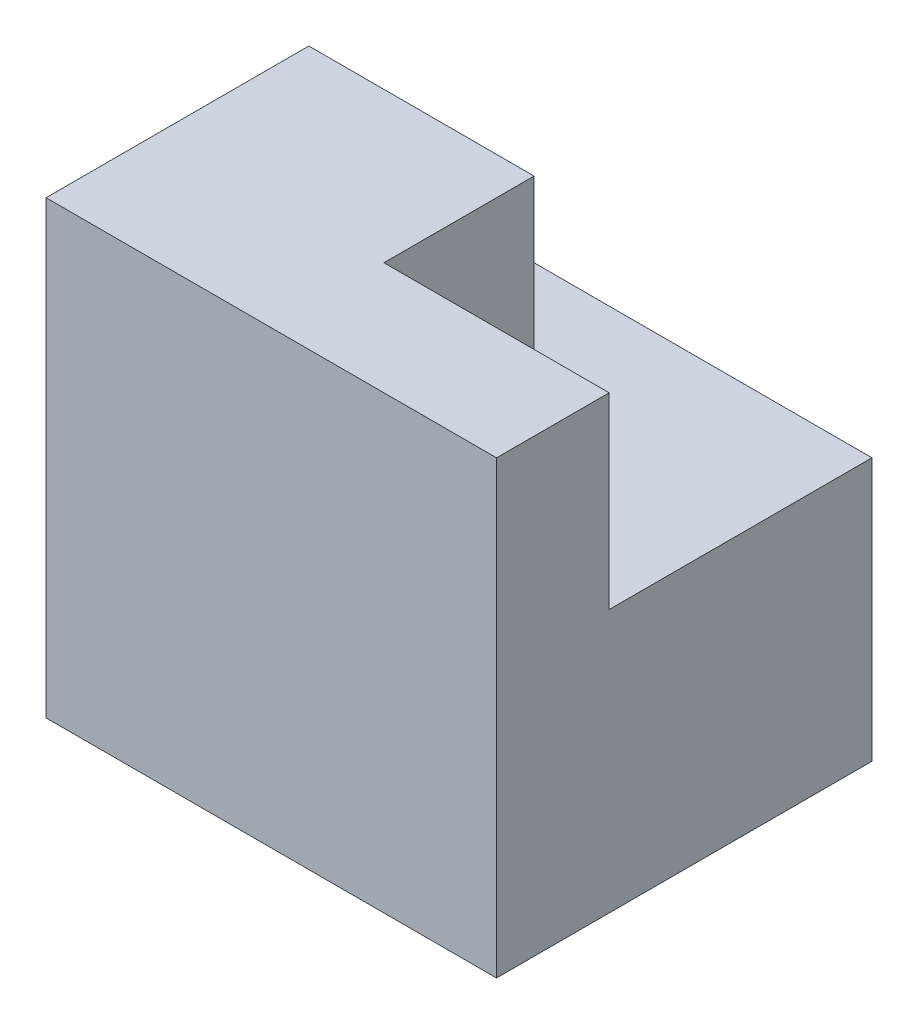
ISO-10303-21;
HEADER;
FILE_DESCRIPTION(('STEP AP214'),'2;1');
FILE_NAME('part.step','',(''),(''),'','','');
FILE_SCHEMA(('AUTOMOTIVE_DESIGN { 1 0 10303 214 1 1 1 1 }'));
ENDSEC;
DATA;
#1=APPLICATION_CONTEXT('core data for automotive mechanical design processes');
#2=APPLICATION_PROTOCOL_DEFINITION('international standard','automotive_design',2000,#1);
#3=PRODUCT_CONTEXT('',#1,'mechanical');
#4=PRODUCT('Part','Part','',(#3));
#5=PRODUCT_RELATED_PRODUCT_CATEGORY('part','',(#4));
#6=PRODUCT_DEFINITION_FORMATION('','',#4);
#7=PRODUCT_DEFINITION_CONTEXT('part definition',#1,'design');
#8=PRODUCT_DEFINITION('design','',#6,#7);
#9=PRODUCT_DEFINITION_SHAPE('','',#8);
#10=(LENGTH_UNIT() NAMED_UNIT(*) SI_UNIT(.MILLI.,.METRE.));
#11=(NAMED_UNIT(*) PLANE_ANGLE_UNIT() SI_UNIT($,.RADIAN.));
#12=(NAMED_UNIT(*) SI_UNIT($,.STERADIAN.) SOLID_ANGLE_UNIT());
#13=UNCERTAINTY_MEASURE_WITH_UNIT(LENGTH_MEASURE(1.E-05),#10,'distance_accuracy_value','');
#14=(GEOMETRIC_REPRESENTATION_CONTEXT(3) GLOBAL_UNCERTAINTY_ASSIGNED_CONTEXT((#13)) GLOBAL_UNIT_ASSIGNED_CONTEXT((#10,
#11,#12)) REPRESENTATION_CONTEXT('',''));
#15=CARTESIAN_POINT('',(0.,0.,0.));
#16=DIRECTION('',(0.,0.,1.));
#17=DIRECTION('',(1.,0.,0.));
#18=AXIS2_PLACEMENT_3D('',#15,#16,#17);
#19=CARTESIAN_POINT('',(3.,6.,2.5));
#20=DIRECTION('',(-1.,0.,0.));
#21=DIRECTION('',(0.,0.,1.));
#22=AXIS2_PLACEMENT_3D('',#19,#20,#21);
#23=PLANE('',#22);
#24=DIRECTION('',(0.,1.,0.));
#25=VECTOR('',#24,1.);
#26=CARTESIAN_POINT('',(3.,3.5,1.));
#27=LINE('',#26,#25);
#28=CARTESIAN_POINT('',(3.,3.5,1.));
#29=VERTEX_POINT('',#28);
#30=CARTESIAN_POINT('',(3.,6.,1.));
#31=VERTEX_POINT('',#30);
#32=EDGE_CURVE('E100',#29,#31,#27,.T.);
#33=ORIENTED_EDGE('',*,*,#32,.T.);
#34=DIRECTION('',(0.,0.,-1.));
#35=VECTOR('',#34,1.);
#36=CARTESIAN_POINT('',(3.,6.,2.5));
#37=LINE('',#36,#35);
#38=CARTESIAN_POINT('',(3.,6.,2.5));
#39=VERTEX_POINT('',#38);
#40=EDGE_CURVE('E84',#39,#31,#37,.T.);
#41=ORIENTED_EDGE('',*,*,#40,.F.);
#42=DIRECTION('',(0.,-1.,0.));
#43=VECTOR('',#42,1.);
#44=CARTESIAN_POINT('',(3.,6.,2.5));
#45=LINE('',#44,#43);
#46=CARTESIAN_POINT('',(3.,0.,2.5));
#47=VERTEX_POINT('',#46);
#48=EDGE_CURVE('E77',#39,#47,#45,.T.);
#49=ORIENTED_EDGE('',*,*,#48,.T.);
#50=DIRECTION('',(0.,0.,-1.));
#51=VECTOR('',#50,1.);
#52=CARTESIAN_POINT('',(3.,0.,2.5));
#53=LINE('',#52,#51);
#54=CARTESIAN_POINT('',(3.,0.,-2.5));
#55=VERTEX_POINT('',#54);
#56=EDGE_CURVE('E91',#47,#55,#53,.T.);
#57=ORIENTED_EDGE('',*,*,#56,.T.);
#58=DIRECTION('',(0.,-1.,0.));
#59=VECTOR('',#58,1.);
#60=CARTESIAN_POINT('',(3.,6.,-2.5));
#61=LINE('',#60,#59);
#62=CARTESIAN_POINT('',(3.,3.5,-2.5));
#63=VERTEX_POINT('',#62);
#64=EDGE_CURVE('E11',#63,#55,#61,.T.);
#65=ORIENTED_EDGE('',*,*,#64,.F.);
#66=DIRECTION('',(0.,0.,-1.));
#67=VECTOR('',#66,1.);
#68=CARTESIAN_POINT('',(3.,3.5,0.));
#69=LINE('',#68,#67);
#70=EDGE_CURVE('E123',#29,#63,#69,.T.);
#71=ORIENTED_EDGE('',*,*,#70,.F.);
#72=EDGE_LOOP('',(#33,#41,#49,#57,#65,#71));
#73=FACE_BOUND('',#72,.T.);
#74=ADVANCED_FACE('F33',(#73),#23,.F.);
#75=CARTESIAN_POINT('',(-3.,6.,-2.5));
#76=DIRECTION('',(0.,0.,1.));
#77=DIRECTION('',(1.,0.,0.));
#78=AXIS2_PLACEMENT_3D('',#75,#76,#77);
#79=PLANE('',#78);
#80=DIRECTION('',(-1.,0.,0.));
#81=VECTOR('',#80,1.);
#82=CARTESIAN_POINT('',(0.,3.5,-2.5));
#83=LINE('',#82,#81);
#84=CARTESIAN_POINT('',(-3.,3.5,-2.5));
#85=VERTEX_POINT('',#84);
#86=EDGE_CURVE('E119',#63,#85,#83,.T.);
#87=ORIENTED_EDGE('',*,*,#86,.F.);
#88=ORIENTED_EDGE('',*,*,#64,.T.);
#89=DIRECTION('',(-1.,0.,0.));
#90=VECTOR('',#89,1.);
#91=CARTESIAN_POINT('',(-3.,0.,-2.5));
#92=LINE('',#91,#90);
#93=CARTESIAN_POINT('',(-3.,0.,-2.5));
#94=VERTEX_POINT('',#93);
#95=EDGE_CURVE('E96',#55,#94,#92,.T.);
#96=ORIENTED_EDGE('',*,*,#95,.T.);
#97=DIRECTION('',(0.,-1.,0.));
#98=VECTOR('',#97,1.);
#99=CARTESIAN_POINT('',(-3.,6.,-2.5));
#100=LINE('',#99,#98);
#101=EDGE_CURVE('E40',#85,#94,#100,.T.);
#102=ORIENTED_EDGE('',*,*,#101,.F.);
#103=EDGE_LOOP('',(#87,#88,#96,#102));
#104=FACE_BOUND('',#103,.T.);
#105=ADVANCED_FACE('F116',(#104),#79,.F.);
#106=CARTESIAN_POINT('',(-3.,6.,2.5));
#107=DIRECTION('',(1.,0.,0.));
#108=DIRECTION('',(0.,0.,-1.));
#109=AXIS2_PLACEMENT_3D('',#106,#107,#108);
#110=PLANE('',#109);
#111=DIRECTION('',(0.,1.,0.));
#112=VECTOR('',#111,1.);
#113=CARTESIAN_POINT('',(-3.,3.5,-1.));
#114=LINE('',#113,#112);
#115=CARTESIAN_POINT('',(-3.,3.5,-1.));
#116=VERTEX_POINT('',#115);
#117=CARTESIAN_POINT('',(-3.,6.,-1.));
#118=VERTEX_POINT('',#117);
#119=EDGE_CURVE('E97',#116,#118,#114,.T.);
#120=ORIENTED_EDGE('',*,*,#119,.F.);
#121=DIRECTION('',(0.,0.,1.));
#122=VECTOR('',#121,1.);
#123=CARTESIAN_POINT('',(-3.,3.5,0.));
#124=LINE('',#123,#122);
#125=EDGE_CURVE('E113',#85,#116,#124,.T.);
#126=ORIENTED_EDGE('',*,*,#125,.F.);
#127=ORIENTED_EDGE('',*,*,#101,.T.);
#128=DIRECTION('',(0.,0.,1.));
#129=VECTOR('',#128,1.);
#130=CARTESIAN_POINT('',(-3.,0.,2.5));
#131=LINE('',#130,#129);
#132=CARTESIAN_POINT('',(-3.,0.,2.5));
#133=VERTEX_POINT('',#132);
#134=EDGE_CURVE('E85',#94,#133,#131,.T.);
#135=ORIENTED_EDGE('',*,*,#134,.T.);
#136=DIRECTION('',(0.,-1.,0.));
#137=VECTOR('',#136,1.);
#138=CARTESIAN_POINT('',(-3.,6.,2.5));
#139=LINE('',#138,#137);
#140=CARTESIAN_POINT('',(-3.,6.,2.5));
#141=VERTEX_POINT('',#140);
#142=EDGE_CURVE('E80',#141,#133,#139,.T.);
#143=ORIENTED_EDGE('',*,*,#142,.F.);
#144=DIRECTION('',(0.,0.,1.));
#145=VECTOR('',#144,1.);
#146=CARTESIAN_POINT('',(-3.,6.,2.5));
#147=LINE('',#146,#145);
#148=EDGE_CURVE('E176',#118,#141,#147,.T.);
#149=ORIENTED_EDGE('',*,*,#148,.F.);
#150=EDGE_LOOP('',(#120,#126,#127,#135,#143,#149));
#151=FACE_BOUND('',#150,.T.);
#152=ADVANCED_FACE('F110',(#151),#110,.F.);
#153=CARTESIAN_POINT('',(0.,6.,0.));
#154=DIRECTION('',(0.,-1.,0.));
#155=DIRECTION('',(0.,0.,-1.));
#156=AXIS2_PLACEMENT_3D('',#153,#154,#155);
#157=PLANE('',#156);
#158=DIRECTION('',(-1.,0.,0.));
#159=VECTOR('',#158,1.);
#160=CARTESIAN_POINT('',(0.,6.,-1.));
#161=LINE('',#160,#159);
#162=CARTESIAN_POINT('',(0.,6.,-1.));
#163=VERTEX_POINT('',#162);
#164=EDGE_CURVE('E47',#163,#118,#161,.T.);
#165=ORIENTED_EDGE('',*,*,#164,.T.);
#166=ORIENTED_EDGE('',*,*,#148,.T.);
#167=DIRECTION('',(1.,0.,0.));
#168=VECTOR('',#167,1.);
#169=CARTESIAN_POINT('',(-3.,6.,2.5));
#170=LINE('',#169,#168);
#171=EDGE_CURVE('E56',#141,#39,#170,.T.);
#172=ORIENTED_EDGE('',*,*,#171,.T.);
#173=ORIENTED_EDGE('',*,*,#40,.T.);
#174=DIRECTION('',(-1.,0.,0.));
#175=VECTOR('',#174,1.);
#176=CARTESIAN_POINT('',(0.,6.,1.));
#177=LINE('',#176,#175);
#178=CARTESIAN_POINT('',(0.,6.,1.));
#179=VERTEX_POINT('',#178);
#180=EDGE_CURVE('E165',#31,#179,#177,.T.);
#181=ORIENTED_EDGE('',*,*,#180,.T.);
#182=DIRECTION('',(0.,0.,-1.));
#183=VECTOR('',#182,1.);
#184=CARTESIAN_POINT('',(0.,6.,0.));
#185=LINE('',#184,#183);
#186=EDGE_CURVE('E157',#179,#163,#185,.T.);
#187=ORIENTED_EDGE('',*,*,#186,.T.);
#188=EDGE_LOOP('',(#165,#166,#172,#173,#181,#187));
#189=FACE_BOUND('',#188,.T.);
#190=ADVANCED_FACE('F178',(#189),#157,.F.);
#191=CARTESIAN_POINT('',(-3.,6.,2.5));
#192=DIRECTION('',(0.,0.,-1.));
#193=DIRECTION('',(-1.,0.,0.));
#194=AXIS2_PLACEMENT_3D('',#191,#192,#193);
#195=PLANE('',#194);
#196=DIRECTION('',(1.,0.,0.));
#197=VECTOR('',#196,1.);
#198=CARTESIAN_POINT('',(-3.,0.,2.5));
#199=LINE('',#198,#197);
#200=EDGE_CURVE('E74',#133,#47,#199,.T.);
#201=ORIENTED_EDGE('',*,*,#200,.T.);
#202=ORIENTED_EDGE('',*,*,#48,.F.);
#203=ORIENTED_EDGE('',*,*,#171,.F.);
#204=ORIENTED_EDGE('',*,*,#142,.T.);
#205=EDGE_LOOP('',(#201,#202,#203,#204));
#206=FACE_BOUND('',#205,.T.);
#207=ADVANCED_FACE('F76',(#206),#195,.F.);
#208=CARTESIAN_POINT('',(0.,0.,0.));
#209=DIRECTION('',(0.,-1.,0.));
#210=DIRECTION('',(0.,0.,-1.));
#211=AXIS2_PLACEMENT_3D('',#208,#209,#210);
#212=PLANE('',#211);
#213=ORIENTED_EDGE('',*,*,#56,.F.);
#214=ORIENTED_EDGE('',*,*,#200,.F.);
#215=ORIENTED_EDGE('',*,*,#134,.F.);
#216=ORIENTED_EDGE('',*,*,#95,.F.);
#217=EDGE_LOOP('',(#213,#214,#215,#216));
#218=FACE_BOUND('',#217,.T.);
#219=ADVANCED_FACE('F94',(#218),#212,.T.);
#220=CARTESIAN_POINT('',(0.,3.5,-1.));
#221=DIRECTION('',(0.,0.,-1.));
#222=DIRECTION('',(-1.,0.,0.));
#223=AXIS2_PLACEMENT_3D('',#220,#221,#222);
#224=PLANE('',#223);
#225=ORIENTED_EDGE('',*,*,#164,.F.);
#226=DIRECTION('',(0.,1.,0.));
#227=VECTOR('',#226,1.);
#228=CARTESIAN_POINT('',(0.,3.5,-1.));
#229=LINE('',#228,#227);
#230=CARTESIAN_POINT('',(0.,3.5,-1.));
#231=VERTEX_POINT('',#230);
#232=EDGE_CURVE('E159',#231,#163,#229,.T.);
#233=ORIENTED_EDGE('',*,*,#232,.F.);
#234=DIRECTION('',(-1.,0.,0.));
#235=VECTOR('',#234,1.);
#236=CARTESIAN_POINT('',(0.,3.5,-1.));
#237=LINE('',#236,#235);
#238=EDGE_CURVE('E163',#231,#116,#237,.T.);
#239=ORIENTED_EDGE('',*,*,#238,.T.);
#240=ORIENTED_EDGE('',*,*,#119,.T.);
#241=EDGE_LOOP('',(#225,#233,#239,#240));
#242=FACE_BOUND('',#241,.T.);
#243=ADVANCED_FACE('F196',(#242),#224,.T.);
#244=CARTESIAN_POINT('',(0.,3.5,1.));
#245=DIRECTION('',(0.,0.,-1.));
#246=DIRECTION('',(-1.,0.,0.));
#247=AXIS2_PLACEMENT_3D('',#244,#245,#246);
#248=PLANE('',#247);
#249=ORIENTED_EDGE('',*,*,#180,.F.);
#250=ORIENTED_EDGE('',*,*,#32,.F.);
#251=DIRECTION('',(-1.,0.,0.));
#252=VECTOR('',#251,1.);
#253=CARTESIAN_POINT('',(0.,3.5,1.));
#254=LINE('',#253,#252);
#255=CARTESIAN_POINT('',(0.,3.5,1.));
#256=VERTEX_POINT('',#255);
#257=EDGE_CURVE('E150',#29,#256,#254,.T.);
#258=ORIENTED_EDGE('',*,*,#257,.T.);
#259=DIRECTION('',(0.,1.,0.));
#260=VECTOR('',#259,1.);
#261=CARTESIAN_POINT('',(0.,3.5,1.));
#262=LINE('',#261,#260);
#263=EDGE_CURVE('E152',#256,#179,#262,.T.);
#264=ORIENTED_EDGE('',*,*,#263,.T.);
#265=EDGE_LOOP('',(#249,#250,#258,#264));
#266=FACE_BOUND('',#265,.T.);
#267=ADVANCED_FACE('F151',(#266),#248,.T.);
#268=CARTESIAN_POINT('',(0.,3.5,0.));
#269=DIRECTION('',(1.,0.,0.));
#270=DIRECTION('',(0.,0.,-1.));
#271=AXIS2_PLACEMENT_3D('',#268,#269,#270);
#272=PLANE('',#271);
#273=ORIENTED_EDGE('',*,*,#186,.F.);
#274=ORIENTED_EDGE('',*,*,#263,.F.);
#275=DIRECTION('',(0.,0.,-1.));
#276=VECTOR('',#275,1.);
#277=CARTESIAN_POINT('',(0.,3.5,0.));
#278=LINE('',#277,#276);
#279=EDGE_CURVE('E147',#256,#231,#278,.T.);
#280=ORIENTED_EDGE('',*,*,#279,.T.);
#281=ORIENTED_EDGE('',*,*,#232,.T.);
#282=EDGE_LOOP('',(#273,#274,#280,#281));
#283=FACE_BOUND('',#282,.T.);
#284=ADVANCED_FACE('F155',(#283),#272,.T.);
#285=CARTESIAN_POINT('',(0.,3.5,0.));
#286=DIRECTION('',(0.,1.,0.));
#287=DIRECTION('',(0.,0.,1.));
#288=AXIS2_PLACEMENT_3D('',#285,#286,#287);
#289=PLANE('',#288);
#290=ORIENTED_EDGE('',*,*,#238,.F.);
#291=ORIENTED_EDGE('',*,*,#279,.F.);
#292=ORIENTED_EDGE('',*,*,#257,.F.);
#293=ORIENTED_EDGE('',*,*,#70,.T.);
#294=ORIENTED_EDGE('',*,*,#86,.T.);
#295=ORIENTED_EDGE('',*,*,#125,.T.);
#296=EDGE_LOOP('',(#290,#291,#292,#293,#294,#295));
#297=FACE_BOUND('',#296,.T.);
#298=ADVANCED_FACE('F162',(#297),#289,.T.);
#299=CLOSED_SHELL('',(#74,#105,#152,#190,#207,#219,#243,#267,#284,#298));
#300=MANIFOLD_SOLID_BREP('B2',#299);
#301=ADVANCED_BREP_SHAPE_REPRESENTATION('',(#18,#300),#14);
#302=SHAPE_DEFINITION_REPRESENTATION(#9,#301);
ENDSEC;
END-ISO-10303-21;
